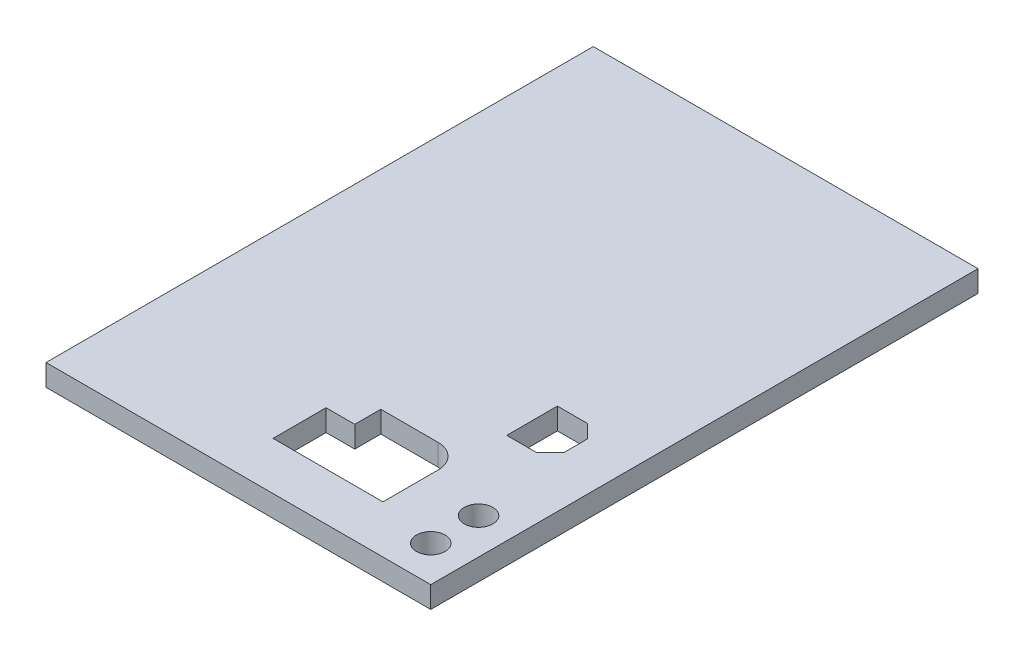
ISO-10303-21;
HEADER;
FILE_DESCRIPTION(('STEP AP214'),'2;1');
FILE_NAME('part.step','',(''),(''),'','','');
FILE_SCHEMA(('AUTOMOTIVE_DESIGN { 1 0 10303 214 1 1 1 1 }'));
ENDSEC;
DATA;
#1=APPLICATION_CONTEXT('core data for automotive mechanical design processes');
#2=APPLICATION_PROTOCOL_DEFINITION('international standard','automotive_design',2000,#1);
#3=PRODUCT_CONTEXT('',#1,'mechanical');
#4=PRODUCT('Part','Part','',(#3));
#5=PRODUCT_RELATED_PRODUCT_CATEGORY('part','',(#4));
#6=PRODUCT_DEFINITION_FORMATION('','',#4);
#7=PRODUCT_DEFINITION_CONTEXT('part definition',#1,'design');
#8=PRODUCT_DEFINITION('design','',#6,#7);
#9=PRODUCT_DEFINITION_SHAPE('','',#8);
#10=(LENGTH_UNIT() NAMED_UNIT(*) SI_UNIT(.MILLI.,.METRE.));
#11=(NAMED_UNIT(*) PLANE_ANGLE_UNIT() SI_UNIT($,.RADIAN.));
#12=(NAMED_UNIT(*) SI_UNIT($,.STERADIAN.) SOLID_ANGLE_UNIT());
#13=UNCERTAINTY_MEASURE_WITH_UNIT(LENGTH_MEASURE(1.E-05),#10,'distance_accuracy_value','');
#14=(GEOMETRIC_REPRESENTATION_CONTEXT(3) GLOBAL_UNCERTAINTY_ASSIGNED_CONTEXT((#13)) GLOBAL_UNIT_ASSIGNED_CONTEXT((#10,
#11,#12)) REPRESENTATION_CONTEXT('',''));
#15=CARTESIAN_POINT('',(0.,0.,0.));
#16=DIRECTION('',(0.,0.,1.));
#17=DIRECTION('',(1.,0.,0.));
#18=AXIS2_PLACEMENT_3D('',#15,#16,#17);
#19=CARTESIAN_POINT('',(80.5,9.,114.5));
#20=DIRECTION('',(-1.,0.,0.));
#21=DIRECTION('',(0.,0.,1.));
#22=AXIS2_PLACEMENT_3D('',#19,#20,#21);
#23=PLANE('',#22);
#24=DIRECTION('',(0.,0.,-1.));
#25=VECTOR('',#24,1.);
#26=CARTESIAN_POINT('',(80.5,0.,114.5));
#27=LINE('',#26,#25);
#28=CARTESIAN_POINT('',(80.5,0.,114.5));
#29=VERTEX_POINT('',#28);
#30=CARTESIAN_POINT('',(80.5,0.,-114.5));
#31=VERTEX_POINT('',#30);
#32=EDGE_CURVE('E231',#29,#31,#27,.T.);
#33=ORIENTED_EDGE('',*,*,#32,.T.);
#34=DIRECTION('',(0.,-1.,0.));
#35=VECTOR('',#34,1.);
#36=CARTESIAN_POINT('',(80.5,9.,-114.5));
#37=LINE('',#36,#35);
#38=CARTESIAN_POINT('',(80.5,9.,-114.5));
#39=VERTEX_POINT('',#38);
#40=EDGE_CURVE('E11',#39,#31,#37,.T.);
#41=ORIENTED_EDGE('',*,*,#40,.F.);
#42=DIRECTION('',(0.,0.,-1.));
#43=VECTOR('',#42,1.);
#44=CARTESIAN_POINT('',(80.5,9.,114.5));
#45=LINE('',#44,#43);
#46=CARTESIAN_POINT('',(80.5,9.,114.5));
#47=VERTEX_POINT('',#46);
#48=EDGE_CURVE('E326',#47,#39,#45,.T.);
#49=ORIENTED_EDGE('',*,*,#48,.F.);
#50=DIRECTION('',(0.,-1.,0.));
#51=VECTOR('',#50,1.);
#52=CARTESIAN_POINT('',(80.5,9.,114.5));
#53=LINE('',#52,#51);
#54=EDGE_CURVE('E340',#47,#29,#53,.T.);
#55=ORIENTED_EDGE('',*,*,#54,.T.);
#56=EDGE_LOOP('',(#33,#41,#49,#55));
#57=FACE_BOUND('',#56,.T.);
#58=ADVANCED_FACE('F42',(#57),#23,.F.);
#59=CARTESIAN_POINT('',(-80.5,9.,-114.5));
#60=DIRECTION('',(0.,0.,1.));
#61=DIRECTION('',(1.,0.,0.));
#62=AXIS2_PLACEMENT_3D('',#59,#60,#61);
#63=PLANE('',#62);
#64=DIRECTION('',(-1.,0.,0.));
#65=VECTOR('',#64,1.);
#66=CARTESIAN_POINT('',(-80.5,0.,-114.5));
#67=LINE('',#66,#65);
#68=CARTESIAN_POINT('',(-80.5,0.,-114.5));
#69=VERTEX_POINT('',#68);
#70=EDGE_CURVE('E344',#31,#69,#67,.T.);
#71=ORIENTED_EDGE('',*,*,#70,.T.);
#72=DIRECTION('',(0.,-1.,0.));
#73=VECTOR('',#72,1.);
#74=CARTESIAN_POINT('',(-80.5,9.,-114.5));
#75=LINE('',#74,#73);
#76=CARTESIAN_POINT('',(-80.5,9.,-114.5));
#77=VERTEX_POINT('',#76);
#78=EDGE_CURVE('E50',#77,#69,#75,.T.);
#79=ORIENTED_EDGE('',*,*,#78,.F.);
#80=DIRECTION('',(-1.,0.,0.));
#81=VECTOR('',#80,1.);
#82=CARTESIAN_POINT('',(-80.5,9.,-114.5));
#83=LINE('',#82,#81);
#84=EDGE_CURVE('E330',#39,#77,#83,.T.);
#85=ORIENTED_EDGE('',*,*,#84,.F.);
#86=ORIENTED_EDGE('',*,*,#40,.T.);
#87=EDGE_LOOP('',(#71,#79,#85,#86));
#88=FACE_BOUND('',#87,.T.);
#89=ADVANCED_FACE('F379',(#88),#63,.F.);
#90=CARTESIAN_POINT('',(-80.5,9.,114.5));
#91=DIRECTION('',(1.,0.,0.));
#92=DIRECTION('',(0.,0.,-1.));
#93=AXIS2_PLACEMENT_3D('',#90,#91,#92);
#94=PLANE('',#93);
#95=DIRECTION('',(0.,0.,1.));
#96=VECTOR('',#95,1.);
#97=CARTESIAN_POINT('',(-80.5,0.,114.5));
#98=LINE('',#97,#96);
#99=CARTESIAN_POINT('',(-80.5,0.,114.5));
#100=VERTEX_POINT('',#99);
#101=EDGE_CURVE('E347',#69,#100,#98,.T.);
#102=ORIENTED_EDGE('',*,*,#101,.T.);
#103=DIRECTION('',(0.,-1.,0.));
#104=VECTOR('',#103,1.);
#105=CARTESIAN_POINT('',(-80.5,9.,114.5));
#106=LINE('',#105,#104);
#107=CARTESIAN_POINT('',(-80.5,9.,114.5));
#108=VERTEX_POINT('',#107);
#109=EDGE_CURVE('E355',#108,#100,#106,.T.);
#110=ORIENTED_EDGE('',*,*,#109,.F.);
#111=DIRECTION('',(0.,0.,1.));
#112=VECTOR('',#111,1.);
#113=CARTESIAN_POINT('',(-80.5,9.,114.5));
#114=LINE('',#113,#112);
#115=EDGE_CURVE('E334',#77,#108,#114,.T.);
#116=ORIENTED_EDGE('',*,*,#115,.F.);
#117=ORIENTED_EDGE('',*,*,#78,.T.);
#118=EDGE_LOOP('',(#102,#110,#116,#117));
#119=FACE_BOUND('',#118,.T.);
#120=ADVANCED_FACE('F364',(#119),#94,.F.);
#121=CARTESIAN_POINT('',(-80.5,9.,114.5));
#122=DIRECTION('',(0.,0.,-1.));
#123=DIRECTION('',(-1.,0.,0.));
#124=AXIS2_PLACEMENT_3D('',#121,#122,#123);
#125=PLANE('',#124);
#126=DIRECTION('',(1.,0.,0.));
#127=VECTOR('',#126,1.);
#128=CARTESIAN_POINT('',(-80.5,0.,114.5));
#129=LINE('',#128,#127);
#130=EDGE_CURVE('E331',#100,#29,#129,.T.);
#131=ORIENTED_EDGE('',*,*,#130,.T.);
#132=ORIENTED_EDGE('',*,*,#54,.F.);
#133=DIRECTION('',(1.,0.,0.));
#134=VECTOR('',#133,1.);
#135=CARTESIAN_POINT('',(-80.5,9.,114.5));
#136=LINE('',#135,#134);
#137=EDGE_CURVE('E337',#108,#47,#136,.T.);
#138=ORIENTED_EDGE('',*,*,#137,.F.);
#139=ORIENTED_EDGE('',*,*,#109,.T.);
#140=EDGE_LOOP('',(#131,#132,#138,#139));
#141=FACE_BOUND('',#140,.T.);
#142=ADVANCED_FACE('F372',(#141),#125,.F.);
#143=CARTESIAN_POINT('',(0.,9.,0.));
#144=DIRECTION('',(0.,-1.,0.));
#145=DIRECTION('',(0.,0.,-1.));
#146=AXIS2_PLACEMENT_3D('',#143,#144,#145);
#147=PLANE('',#146);
#148=DIRECTION('',(-1.,0.,0.));
#149=VECTOR('',#148,1.);
#150=CARTESIAN_POINT('',(6.50000000000002,9.,72.3));
#151=LINE('',#150,#149);
#152=CARTESIAN_POINT('',(6.50000000000002,9.,72.3));
#153=VERTEX_POINT('',#152);
#154=CARTESIAN_POINT('',(-5.49999999999998,9.,72.3));
#155=VERTEX_POINT('',#154);
#156=EDGE_CURVE('E210',#153,#155,#151,.T.);
#157=ORIENTED_EDGE('',*,*,#156,.F.);
#158=DIRECTION('',(0.,0.,1.));
#159=VECTOR('',#158,1.);
#160=CARTESIAN_POINT('',(6.50000000000002,9.,61.4));
#161=LINE('',#160,#159);
#162=CARTESIAN_POINT('',(6.50000000000002,9.,61.4));
#163=VERTEX_POINT('',#162);
#164=EDGE_CURVE('E57',#163,#153,#161,.T.);
#165=ORIENTED_EDGE('',*,*,#164,.F.);
#166=DIRECTION('',(-1.,0.,0.));
#167=VECTOR('',#166,1.);
#168=CARTESIAN_POINT('',(30.5,9.,61.4));
#169=LINE('',#168,#167);
#170=CARTESIAN_POINT('',(30.5,9.,61.4));
#171=VERTEX_POINT('',#170);
#172=EDGE_CURVE('E186',#171,#163,#169,.T.);
#173=ORIENTED_EDGE('',*,*,#172,.F.);
#174=CARTESIAN_POINT('',(30.5,9.,71.4));
#175=DIRECTION('',(0.,1.,0.));
#176=DIRECTION('',(0.,0.,1.));
#177=AXIS2_PLACEMENT_3D('',#174,#175,#176);
#178=CIRCLE('',#177,10.);
#179=CARTESIAN_POINT('',(40.5,9.,71.4));
#180=VERTEX_POINT('',#179);
#181=EDGE_CURVE('E190',#180,#171,#178,.T.);
#182=ORIENTED_EDGE('',*,*,#181,.F.);
#183=DIRECTION('',(0.,0.,-1.));
#184=VECTOR('',#183,1.);
#185=CARTESIAN_POINT('',(40.5,9.,94.5));
#186=LINE('',#185,#184);
#187=CARTESIAN_POINT('',(40.5,9.,94.5));
#188=VERTEX_POINT('',#187);
#189=EDGE_CURVE('E221',#188,#180,#186,.T.);
#190=ORIENTED_EDGE('',*,*,#189,.F.);
#191=DIRECTION('',(1.,0.,0.));
#192=VECTOR('',#191,1.);
#193=CARTESIAN_POINT('',(40.5,9.,94.5));
#194=LINE('',#193,#192);
#195=CARTESIAN_POINT('',(-5.49999999999998,9.,94.5));
#196=VERTEX_POINT('',#195);
#197=EDGE_CURVE('E217',#196,#188,#194,.T.);
#198=ORIENTED_EDGE('',*,*,#197,.F.);
#199=DIRECTION('',(0.,0.,1.));
#200=VECTOR('',#199,1.);
#201=CARTESIAN_POINT('',(-5.49999999999998,9.,94.5));
#202=LINE('',#201,#200);
#203=EDGE_CURVE('E213',#155,#196,#202,.T.);
#204=ORIENTED_EDGE('',*,*,#203,.F.);
#205=EDGE_LOOP('',(#157,#165,#173,#182,#190,#198,#204));
#206=FACE_BOUND('',#205,.T.);
#207=CARTESIAN_POINT('',(65.5,9.,79.5));
#208=DIRECTION('',(0.,1.,0.));
#209=DIRECTION('',(0.,0.,1.));
#210=AXIS2_PLACEMENT_3D('',#207,#208,#209);
#211=CIRCLE('',#210,5.99999999999999);
#212=CARTESIAN_POINT('',(65.5,9.,85.5));
#213=VERTEX_POINT('',#212);
#214=EDGE_CURVE('E246',#213,#213,#211,.T.);
#215=ORIENTED_EDGE('',*,*,#214,.F.);
#216=EDGE_LOOP('',(#215));
#217=FACE_BOUND('',#216,.T.);
#218=CARTESIAN_POINT('',(65.5,9.,99.5));
#219=DIRECTION('',(0.,1.,0.));
#220=DIRECTION('',(0.,0.,1.));
#221=AXIS2_PLACEMENT_3D('',#218,#219,#220);
#222=CIRCLE('',#221,5.99999999999999);
#223=CARTESIAN_POINT('',(65.5,9.,105.5));
#224=VERTEX_POINT('',#223);
#225=EDGE_CURVE('E274',#224,#224,#222,.T.);
#226=ORIENTED_EDGE('',*,*,#225,.F.);
#227=EDGE_LOOP('',(#226));
#228=FACE_BOUND('',#227,.T.);
#229=DIRECTION('',(1.,0.,0.));
#230=VECTOR('',#229,1.);
#231=CARTESIAN_POINT('',(42.3,9.,44.5));
#232=LINE('',#231,#230);
#233=CARTESIAN_POINT('',(42.3,9.,44.5));
#234=VERTEX_POINT('',#233);
#235=CARTESIAN_POINT('',(54.9000000000001,9.,44.5));
#236=VERTEX_POINT('',#235);
#237=EDGE_CURVE('E292',#234,#236,#232,.T.);
#238=ORIENTED_EDGE('',*,*,#237,.F.);
#239=DIRECTION('',(0.,0.,1.));
#240=VECTOR('',#239,1.);
#241=CARTESIAN_POINT('',(42.3,9.,23.3));
#242=LINE('',#241,#240);
#243=CARTESIAN_POINT('',(42.3,9.,23.3));
#244=VERTEX_POINT('',#243);
#245=EDGE_CURVE('E65',#244,#234,#242,.T.);
#246=ORIENTED_EDGE('',*,*,#245,.F.);
#247=DIRECTION('',(-1.,0.,0.));
#248=VECTOR('',#247,1.);
#249=CARTESIAN_POINT('',(42.3,9.,23.3));
#250=LINE('',#249,#248);
#251=CARTESIAN_POINT('',(54.9,9.,23.3));
#252=VERTEX_POINT('',#251);
#253=EDGE_CURVE('E275',#252,#244,#250,.T.);
#254=ORIENTED_EDGE('',*,*,#253,.F.);
#255=DIRECTION('',(-0.70710678118655,0.,-0.707106781186545));
#256=VECTOR('',#255,1.);
#257=CARTESIAN_POINT('',(60.5,9.,28.9));
#258=LINE('',#257,#256);
#259=CARTESIAN_POINT('',(60.5,9.,28.9));
#260=VERTEX_POINT('',#259);
#261=EDGE_CURVE('E279',#260,#252,#258,.T.);
#262=ORIENTED_EDGE('',*,*,#261,.F.);
#263=DIRECTION('',(0.,0.,-1.));
#264=VECTOR('',#263,1.);
#265=CARTESIAN_POINT('',(60.5,9.,38.9));
#266=LINE('',#265,#264);
#267=CARTESIAN_POINT('',(60.5,9.,38.9));
#268=VERTEX_POINT('',#267);
#269=EDGE_CURVE('E284',#268,#260,#266,.T.);
#270=ORIENTED_EDGE('',*,*,#269,.F.);
#271=DIRECTION('',(0.707106781186544,0.,-0.70710678118655));
#272=VECTOR('',#271,1.);
#273=CARTESIAN_POINT('',(54.9000000000001,9.,44.5));
#274=LINE('',#273,#272);
#275=EDGE_CURVE('E288',#236,#268,#274,.T.);
#276=ORIENTED_EDGE('',*,*,#275,.F.);
#277=EDGE_LOOP('',(#238,#246,#254,#262,#270,#276));
#278=FACE_BOUND('',#277,.T.);
#279=ORIENTED_EDGE('',*,*,#48,.T.);
#280=ORIENTED_EDGE('',*,*,#84,.T.);
#281=ORIENTED_EDGE('',*,*,#115,.T.);
#282=ORIENTED_EDGE('',*,*,#137,.T.);
#283=EDGE_LOOP('',(#279,#280,#281,#282));
#284=FACE_BOUND('',#283,.T.);
#285=ADVANCED_FACE('F378',(#206,#217,#228,#278,#284),#147,.F.);
#286=CARTESIAN_POINT('',(0.,0.,0.));
#287=DIRECTION('',(0.,-1.,0.));
#288=DIRECTION('',(0.,0.,-1.));
#289=AXIS2_PLACEMENT_3D('',#286,#287,#288);
#290=PLANE('',#289);
#291=DIRECTION('',(0.,0.,1.));
#292=VECTOR('',#291,1.);
#293=CARTESIAN_POINT('',(6.50000000000002,0.,61.4));
#294=LINE('',#293,#292);
#295=CARTESIAN_POINT('',(6.50000000000002,0.,61.4));
#296=VERTEX_POINT('',#295);
#297=CARTESIAN_POINT('',(6.50000000000002,0.,72.3));
#298=VERTEX_POINT('',#297);
#299=EDGE_CURVE('E163',#296,#298,#294,.T.);
#300=ORIENTED_EDGE('',*,*,#299,.T.);
#301=DIRECTION('',(-1.,0.,0.));
#302=VECTOR('',#301,1.);
#303=CARTESIAN_POINT('',(6.50000000000002,0.,72.3));
#304=LINE('',#303,#302);
#305=CARTESIAN_POINT('',(-5.49999999999998,0.,72.3));
#306=VERTEX_POINT('',#305);
#307=EDGE_CURVE('E174',#298,#306,#304,.T.);
#308=ORIENTED_EDGE('',*,*,#307,.T.);
#309=DIRECTION('',(0.,0.,1.));
#310=VECTOR('',#309,1.);
#311=CARTESIAN_POINT('',(-5.49999999999998,0.,94.5));
#312=LINE('',#311,#310);
#313=CARTESIAN_POINT('',(-5.49999999999998,0.,94.5));
#314=VERTEX_POINT('',#313);
#315=EDGE_CURVE('E179',#306,#314,#312,.T.);
#316=ORIENTED_EDGE('',*,*,#315,.T.);
#317=DIRECTION('',(1.,0.,0.));
#318=VECTOR('',#317,1.);
#319=CARTESIAN_POINT('',(40.5,0.,94.5));
#320=LINE('',#319,#318);
#321=CARTESIAN_POINT('',(40.5,0.,94.5));
#322=VERTEX_POINT('',#321);
#323=EDGE_CURVE('E195',#314,#322,#320,.T.);
#324=ORIENTED_EDGE('',*,*,#323,.T.);
#325=DIRECTION('',(0.,0.,-1.));
#326=VECTOR('',#325,1.);
#327=CARTESIAN_POINT('',(40.5,0.,94.5));
#328=LINE('',#327,#326);
#329=CARTESIAN_POINT('',(40.5,0.,71.4));
#330=VERTEX_POINT('',#329);
#331=EDGE_CURVE('E199',#322,#330,#328,.T.);
#332=ORIENTED_EDGE('',*,*,#331,.T.);
#333=CARTESIAN_POINT('',(30.5,0.,71.4));
#334=DIRECTION('',(0.,1.,0.));
#335=DIRECTION('',(0.,0.,1.));
#336=AXIS2_PLACEMENT_3D('',#333,#334,#335);
#337=CIRCLE('',#336,10.);
#338=CARTESIAN_POINT('',(30.5,0.,61.4));
#339=VERTEX_POINT('',#338);
#340=EDGE_CURVE('E203',#330,#339,#337,.T.);
#341=ORIENTED_EDGE('',*,*,#340,.T.);
#342=DIRECTION('',(-1.,0.,0.));
#343=VECTOR('',#342,1.);
#344=CARTESIAN_POINT('',(30.5,0.,61.4));
#345=LINE('',#344,#343);
#346=EDGE_CURVE('E170',#339,#296,#345,.T.);
#347=ORIENTED_EDGE('',*,*,#346,.T.);
#348=EDGE_LOOP('',(#300,#308,#316,#324,#332,#341,#347));
#349=FACE_BOUND('',#348,.T.);
#350=CARTESIAN_POINT('',(65.5,0.,79.5));
#351=DIRECTION('',(0.,1.,0.));
#352=DIRECTION('',(0.,0.,1.));
#353=AXIS2_PLACEMENT_3D('',#350,#351,#352);
#354=CIRCLE('',#353,5.99999999999999);
#355=CARTESIAN_POINT('',(65.5,0.,85.5));
#356=VERTEX_POINT('',#355);
#357=EDGE_CURVE('E251',#356,#356,#354,.T.);
#358=ORIENTED_EDGE('',*,*,#357,.T.);
#359=EDGE_LOOP('',(#358));
#360=FACE_BOUND('',#359,.T.);
#361=CARTESIAN_POINT('',(65.5,0.,99.5));
#362=DIRECTION('',(0.,1.,0.));
#363=DIRECTION('',(0.,0.,1.));
#364=AXIS2_PLACEMENT_3D('',#361,#362,#363);
#365=CIRCLE('',#364,5.99999999999999);
#366=CARTESIAN_POINT('',(65.5,0.,105.5));
#367=VERTEX_POINT('',#366);
#368=EDGE_CURVE('E250',#367,#367,#365,.T.);
#369=ORIENTED_EDGE('',*,*,#368,.T.);
#370=EDGE_LOOP('',(#369));
#371=FACE_BOUND('',#370,.T.);
#372=DIRECTION('',(0.,0.,1.));
#373=VECTOR('',#372,1.);
#374=CARTESIAN_POINT('',(42.3,0.,23.3));
#375=LINE('',#374,#373);
#376=CARTESIAN_POINT('',(42.3,0.,23.3));
#377=VERTEX_POINT('',#376);
#378=CARTESIAN_POINT('',(42.3,0.,44.5));
#379=VERTEX_POINT('',#378);
#380=EDGE_CURVE('E280',#377,#379,#375,.T.);
#381=ORIENTED_EDGE('',*,*,#380,.T.);
#382=DIRECTION('',(1.,0.,0.));
#383=VECTOR('',#382,1.);
#384=CARTESIAN_POINT('',(42.3,0.,44.5));
#385=LINE('',#384,#383);
#386=CARTESIAN_POINT('',(54.9000000000001,0.,44.5));
#387=VERTEX_POINT('',#386);
#388=EDGE_CURVE('E313',#379,#387,#385,.T.);
#389=ORIENTED_EDGE('',*,*,#388,.T.);
#390=DIRECTION('',(0.707106781186544,0.,-0.70710678118655));
#391=VECTOR('',#390,1.);
#392=CARTESIAN_POINT('',(54.9000000000001,0.,44.5));
#393=LINE('',#392,#391);
#394=CARTESIAN_POINT('',(60.5,0.,38.9));
#395=VERTEX_POINT('',#394);
#396=EDGE_CURVE('E309',#387,#395,#393,.T.);
#397=ORIENTED_EDGE('',*,*,#396,.T.);
#398=DIRECTION('',(0.,0.,-1.));
#399=VECTOR('',#398,1.);
#400=CARTESIAN_POINT('',(60.5,0.,38.9));
#401=LINE('',#400,#399);
#402=CARTESIAN_POINT('',(60.5,0.,28.9));
#403=VERTEX_POINT('',#402);
#404=EDGE_CURVE('E305',#395,#403,#401,.T.);
#405=ORIENTED_EDGE('',*,*,#404,.T.);
#406=DIRECTION('',(-0.70710678118655,0.,-0.707106781186545));
#407=VECTOR('',#406,1.);
#408=CARTESIAN_POINT('',(60.5,0.,28.9));
#409=LINE('',#408,#407);
#410=CARTESIAN_POINT('',(54.9,0.,23.3));
#411=VERTEX_POINT('',#410);
#412=EDGE_CURVE('E301',#403,#411,#409,.T.);
#413=ORIENTED_EDGE('',*,*,#412,.T.);
#414=DIRECTION('',(-1.,0.,0.));
#415=VECTOR('',#414,1.);
#416=CARTESIAN_POINT('',(42.3,0.,23.3));
#417=LINE('',#416,#415);
#418=EDGE_CURVE('E258',#411,#377,#417,.T.);
#419=ORIENTED_EDGE('',*,*,#418,.T.);
#420=EDGE_LOOP('',(#381,#389,#397,#405,#413,#419));
#421=FACE_BOUND('',#420,.T.);
#422=ORIENTED_EDGE('',*,*,#32,.F.);
#423=ORIENTED_EDGE('',*,*,#130,.F.);
#424=ORIENTED_EDGE('',*,*,#101,.F.);
#425=ORIENTED_EDGE('',*,*,#70,.F.);
#426=EDGE_LOOP('',(#422,#423,#424,#425));
#427=FACE_BOUND('',#426,.T.);
#428=ADVANCED_FACE('F181',(#349,#360,#371,#421,#427),#290,.T.);
#429=CARTESIAN_POINT('',(42.3,0.,23.3));
#430=DIRECTION('',(-1.,0.,0.));
#431=DIRECTION('',(0.,0.,1.));
#432=AXIS2_PLACEMENT_3D('',#429,#430,#431);
#433=PLANE('',#432);
#434=ORIENTED_EDGE('',*,*,#245,.T.);
#435=DIRECTION('',(0.,1.,0.));
#436=VECTOR('',#435,1.);
#437=CARTESIAN_POINT('',(42.3,0.,44.5));
#438=LINE('',#437,#436);
#439=EDGE_CURVE('E255',#379,#234,#438,.T.);
#440=ORIENTED_EDGE('',*,*,#439,.F.);
#441=ORIENTED_EDGE('',*,*,#380,.F.);
#442=DIRECTION('',(0.,1.,0.));
#443=VECTOR('',#442,1.);
#444=CARTESIAN_POINT('',(42.3,0.,23.3));
#445=LINE('',#444,#443);
#446=EDGE_CURVE('E271',#377,#244,#445,.T.);
#447=ORIENTED_EDGE('',*,*,#446,.T.);
#448=EDGE_LOOP('',(#434,#440,#441,#447));
#449=FACE_BOUND('',#448,.T.);
#450=ADVANCED_FACE('F391',(#449),#433,.F.);
#451=CARTESIAN_POINT('',(42.3,0.,23.3));
#452=DIRECTION('',(0.,0.,-1.));
#453=DIRECTION('',(-1.,0.,0.));
#454=AXIS2_PLACEMENT_3D('',#451,#452,#453);
#455=PLANE('',#454);
#456=ORIENTED_EDGE('',*,*,#253,.T.);
#457=ORIENTED_EDGE('',*,*,#446,.F.);
#458=ORIENTED_EDGE('',*,*,#418,.F.);
#459=DIRECTION('',(0.,1.,0.));
#460=VECTOR('',#459,1.);
#461=CARTESIAN_POINT('',(54.9,0.,23.3));
#462=LINE('',#461,#460);
#463=EDGE_CURVE('E268',#411,#252,#462,.T.);
#464=ORIENTED_EDGE('',*,*,#463,.T.);
#465=EDGE_LOOP('',(#456,#457,#458,#464));
#466=FACE_BOUND('',#465,.T.);
#467=ADVANCED_FACE('F401',(#466),#455,.F.);
#468=CARTESIAN_POINT('',(60.5,0.,28.9));
#469=DIRECTION('',(0.707106781186545,0.,-0.70710678118655));
#470=DIRECTION('',(-0.70710678118655,0.,-0.707106781186545));
#471=AXIS2_PLACEMENT_3D('',#468,#469,#470);
#472=PLANE('',#471);
#473=ORIENTED_EDGE('',*,*,#261,.T.);
#474=ORIENTED_EDGE('',*,*,#463,.F.);
#475=ORIENTED_EDGE('',*,*,#412,.F.);
#476=DIRECTION('',(0.,1.,0.));
#477=VECTOR('',#476,1.);
#478=CARTESIAN_POINT('',(60.5,0.,28.9));
#479=LINE('',#478,#477);
#480=EDGE_CURVE('E265',#403,#260,#479,.T.);
#481=ORIENTED_EDGE('',*,*,#480,.T.);
#482=EDGE_LOOP('',(#473,#474,#475,#481));
#483=FACE_BOUND('',#482,.T.);
#484=ADVANCED_FACE('F404',(#483),#472,.F.);
#485=CARTESIAN_POINT('',(60.5,0.,38.9));
#486=DIRECTION('',(1.,0.,0.));
#487=DIRECTION('',(0.,0.,-1.));
#488=AXIS2_PLACEMENT_3D('',#485,#486,#487);
#489=PLANE('',#488);
#490=ORIENTED_EDGE('',*,*,#269,.T.);
#491=ORIENTED_EDGE('',*,*,#480,.F.);
#492=ORIENTED_EDGE('',*,*,#404,.F.);
#493=DIRECTION('',(0.,1.,0.));
#494=VECTOR('',#493,1.);
#495=CARTESIAN_POINT('',(60.5,0.,38.9));
#496=LINE('',#495,#494);
#497=EDGE_CURVE('E262',#395,#268,#496,.T.);
#498=ORIENTED_EDGE('',*,*,#497,.T.);
#499=EDGE_LOOP('',(#490,#491,#492,#498));
#500=FACE_BOUND('',#499,.T.);
#501=ADVANCED_FACE('F408',(#500),#489,.F.);
#502=CARTESIAN_POINT('',(54.9000000000001,0.,44.5));
#503=DIRECTION('',(0.707106781186551,0.,0.707106781186545));
#504=DIRECTION('',(0.707106781186545,0.,-0.707106781186551));
#505=AXIS2_PLACEMENT_3D('',#502,#503,#504);
#506=PLANE('',#505);
#507=ORIENTED_EDGE('',*,*,#275,.T.);
#508=ORIENTED_EDGE('',*,*,#497,.F.);
#509=ORIENTED_EDGE('',*,*,#396,.F.);
#510=DIRECTION('',(0.,1.,0.));
#511=VECTOR('',#510,1.);
#512=CARTESIAN_POINT('',(54.9000000000001,0.,44.5));
#513=LINE('',#512,#511);
#514=EDGE_CURVE('E259',#387,#236,#513,.T.);
#515=ORIENTED_EDGE('',*,*,#514,.T.);
#516=EDGE_LOOP('',(#507,#508,#509,#515));
#517=FACE_BOUND('',#516,.T.);
#518=ADVANCED_FACE('F412',(#517),#506,.F.);
#519=CARTESIAN_POINT('',(42.3,0.,44.5));
#520=DIRECTION('',(0.,0.,1.));
#521=DIRECTION('',(1.,0.,0.));
#522=AXIS2_PLACEMENT_3D('',#519,#520,#521);
#523=PLANE('',#522);
#524=ORIENTED_EDGE('',*,*,#237,.T.);
#525=ORIENTED_EDGE('',*,*,#514,.F.);
#526=ORIENTED_EDGE('',*,*,#388,.F.);
#527=ORIENTED_EDGE('',*,*,#439,.T.);
#528=EDGE_LOOP('',(#524,#525,#526,#527));
#529=FACE_BOUND('',#528,.T.);
#530=ADVANCED_FACE('F399',(#529),#523,.F.);
#531=CARTESIAN_POINT('',(65.5,0.,99.5));
#532=DIRECTION('',(0.,1.,0.));
#533=DIRECTION('',(0.,0.,1.));
#534=AXIS2_PLACEMENT_3D('',#531,#532,#533);
#535=CYLINDRICAL_SURFACE('',#534,5.99999999999999);
#536=ORIENTED_EDGE('',*,*,#368,.F.);
#537=EDGE_LOOP('',(#536));
#538=FACE_BOUND('',#537,.T.);
#539=ORIENTED_EDGE('',*,*,#225,.T.);
#540=EDGE_LOOP('',(#539));
#541=FACE_BOUND('',#540,.T.);
#542=ADVANCED_FACE('F395',(#538,#541),#535,.F.);
#543=CARTESIAN_POINT('',(65.5,0.,79.5));
#544=DIRECTION('',(0.,1.,0.));
#545=DIRECTION('',(0.,0.,1.));
#546=AXIS2_PLACEMENT_3D('',#543,#544,#545);
#547=CYLINDRICAL_SURFACE('',#546,5.99999999999999);
#548=ORIENTED_EDGE('',*,*,#357,.F.);
#549=EDGE_LOOP('',(#548));
#550=FACE_BOUND('',#549,.T.);
#551=ORIENTED_EDGE('',*,*,#214,.T.);
#552=EDGE_LOOP('',(#551));
#553=FACE_BOUND('',#552,.T.);
#554=ADVANCED_FACE('F398',(#550,#553),#547,.F.);
#555=CARTESIAN_POINT('',(6.50000000000002,0.,61.4));
#556=DIRECTION('',(-1.,0.,0.));
#557=DIRECTION('',(0.,0.,1.));
#558=AXIS2_PLACEMENT_3D('',#555,#556,#557);
#559=PLANE('',#558);
#560=ORIENTED_EDGE('',*,*,#164,.T.);
#561=DIRECTION('',(0.,1.,0.));
#562=VECTOR('',#561,1.);
#563=CARTESIAN_POINT('',(6.50000000000002,0.,72.3));
#564=LINE('',#563,#562);
#565=EDGE_CURVE('E159',#298,#153,#564,.T.);
#566=ORIENTED_EDGE('',*,*,#565,.F.);
#567=ORIENTED_EDGE('',*,*,#299,.F.);
#568=DIRECTION('',(0.,1.,0.));
#569=VECTOR('',#568,1.);
#570=CARTESIAN_POINT('',(6.50000000000002,0.,61.4));
#571=LINE('',#570,#569);
#572=EDGE_CURVE('E228',#296,#163,#571,.T.);
#573=ORIENTED_EDGE('',*,*,#572,.T.);
#574=EDGE_LOOP('',(#560,#566,#567,#573));
#575=FACE_BOUND('',#574,.T.);
#576=ADVANCED_FACE('F161',(#575),#559,.F.);
#577=CARTESIAN_POINT('',(30.5,0.,61.4));
#578=DIRECTION('',(0.,0.,-1.));
#579=DIRECTION('',(-1.,0.,0.));
#580=AXIS2_PLACEMENT_3D('',#577,#578,#579);
#581=PLANE('',#580);
#582=ORIENTED_EDGE('',*,*,#172,.T.);
#583=ORIENTED_EDGE('',*,*,#572,.F.);
#584=ORIENTED_EDGE('',*,*,#346,.F.);
#585=DIRECTION('',(0.,1.,0.));
#586=VECTOR('',#585,1.);
#587=CARTESIAN_POINT('',(30.5,0.,61.4));
#588=LINE('',#587,#586);
#589=EDGE_CURVE('E232',#339,#171,#588,.T.);
#590=ORIENTED_EDGE('',*,*,#589,.T.);
#591=EDGE_LOOP('',(#582,#583,#584,#590));
#592=FACE_BOUND('',#591,.T.);
#593=ADVANCED_FACE('F427',(#592),#581,.F.);
#594=CARTESIAN_POINT('',(30.5,0.,71.4));
#595=DIRECTION('',(0.,1.,0.));
#596=DIRECTION('',(0.,0.,1.));
#597=AXIS2_PLACEMENT_3D('',#594,#595,#596);
#598=CYLINDRICAL_SURFACE('',#597,10.);
#599=ORIENTED_EDGE('',*,*,#181,.T.);
#600=ORIENTED_EDGE('',*,*,#589,.F.);
#601=ORIENTED_EDGE('',*,*,#340,.F.);
#602=DIRECTION('',(0.,1.,0.));
#603=VECTOR('',#602,1.);
#604=CARTESIAN_POINT('',(40.5,0.,71.4));
#605=LINE('',#604,#603);
#606=EDGE_CURVE('E235',#330,#180,#605,.T.);
#607=ORIENTED_EDGE('',*,*,#606,.T.);
#608=EDGE_LOOP('',(#599,#600,#601,#607));
#609=FACE_BOUND('',#608,.T.);
#610=ADVANCED_FACE('F441',(#609),#598,.F.);
#611=CARTESIAN_POINT('',(40.5,0.,94.5));
#612=DIRECTION('',(1.,0.,0.));
#613=DIRECTION('',(0.,0.,-1.));
#614=AXIS2_PLACEMENT_3D('',#611,#612,#613);
#615=PLANE('',#614);
#616=ORIENTED_EDGE('',*,*,#189,.T.);
#617=ORIENTED_EDGE('',*,*,#606,.F.);
#618=ORIENTED_EDGE('',*,*,#331,.F.);
#619=DIRECTION('',(0.,1.,0.));
#620=VECTOR('',#619,1.);
#621=CARTESIAN_POINT('',(40.5,0.,94.5));
#622=LINE('',#621,#620);
#623=EDGE_CURVE('E238',#322,#188,#622,.T.);
#624=ORIENTED_EDGE('',*,*,#623,.T.);
#625=EDGE_LOOP('',(#616,#617,#618,#624));
#626=FACE_BOUND('',#625,.T.);
#627=ADVANCED_FACE('F437',(#626),#615,.F.);
#628=CARTESIAN_POINT('',(40.5,0.,94.5));
#629=DIRECTION('',(0.,0.,1.));
#630=DIRECTION('',(1.,0.,0.));
#631=AXIS2_PLACEMENT_3D('',#628,#629,#630);
#632=PLANE('',#631);
#633=ORIENTED_EDGE('',*,*,#197,.T.);
#634=ORIENTED_EDGE('',*,*,#623,.F.);
#635=ORIENTED_EDGE('',*,*,#323,.F.);
#636=DIRECTION('',(0.,1.,0.));
#637=VECTOR('',#636,1.);
#638=CARTESIAN_POINT('',(-5.49999999999998,0.,94.5));
#639=LINE('',#638,#637);
#640=EDGE_CURVE('E241',#314,#196,#639,.T.);
#641=ORIENTED_EDGE('',*,*,#640,.T.);
#642=EDGE_LOOP('',(#633,#634,#635,#641));
#643=FACE_BOUND('',#642,.T.);
#644=ADVANCED_FACE('F433',(#643),#632,.F.);
#645=CARTESIAN_POINT('',(-5.49999999999998,0.,94.5));
#646=DIRECTION('',(-1.,0.,0.));
#647=DIRECTION('',(0.,0.,1.));
#648=AXIS2_PLACEMENT_3D('',#645,#646,#647);
#649=PLANE('',#648);
#650=ORIENTED_EDGE('',*,*,#203,.T.);
#651=ORIENTED_EDGE('',*,*,#640,.F.);
#652=ORIENTED_EDGE('',*,*,#315,.F.);
#653=DIRECTION('',(0.,1.,0.));
#654=VECTOR('',#653,1.);
#655=CARTESIAN_POINT('',(-5.49999999999998,0.,72.3));
#656=LINE('',#655,#654);
#657=EDGE_CURVE('E169',#306,#155,#656,.T.);
#658=ORIENTED_EDGE('',*,*,#657,.T.);
#659=EDGE_LOOP('',(#650,#651,#652,#658));
#660=FACE_BOUND('',#659,.T.);
#661=ADVANCED_FACE('F430',(#660),#649,.F.);
#662=CARTESIAN_POINT('',(6.50000000000002,0.,72.3));
#663=DIRECTION('',(0.,0.,-1.));
#664=DIRECTION('',(-1.,0.,0.));
#665=AXIS2_PLACEMENT_3D('',#662,#663,#664);
#666=PLANE('',#665);
#667=ORIENTED_EDGE('',*,*,#156,.T.);
#668=ORIENTED_EDGE('',*,*,#657,.F.);
#669=ORIENTED_EDGE('',*,*,#307,.F.);
#670=ORIENTED_EDGE('',*,*,#565,.T.);
#671=EDGE_LOOP('',(#667,#668,#669,#670));
#672=FACE_BOUND('',#671,.T.);
#673=ADVANCED_FACE('F175',(#672),#666,.F.);
#674=CLOSED_SHELL('',(#58,#89,#120,#142,#285,#428,#450,#467,#484,#501,#518,#530,#542,#554,#576,
#593,#610,#627,#644,#661,#673));
#675=MANIFOLD_SOLID_BREP('B2',#674);
#676=ADVANCED_BREP_SHAPE_REPRESENTATION('',(#18,#675),#14);
#677=SHAPE_DEFINITION_REPRESENTATION(#9,#676);
ENDSEC;
END-ISO-10303-21;
